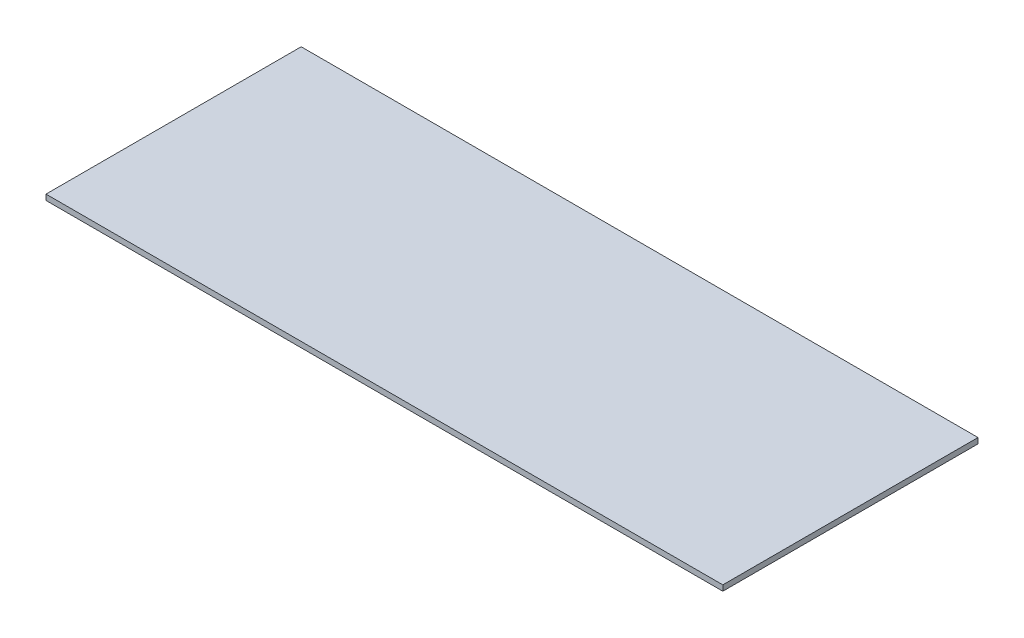
ISO-10303-21;
HEADER;
FILE_DESCRIPTION(('STEP AP214'),'2;1');
FILE_NAME('part.step','',(''),(''),'','','');
FILE_SCHEMA(('AUTOMOTIVE_DESIGN { 1 0 10303 214 1 1 1 1 }'));
ENDSEC;
DATA;
#1=APPLICATION_CONTEXT('core data for automotive mechanical design processes');
#2=APPLICATION_PROTOCOL_DEFINITION('international standard','automotive_design',2000,#1);
#3=PRODUCT_CONTEXT('',#1,'mechanical');
#4=PRODUCT('Part','Part','',(#3));
#5=PRODUCT_RELATED_PRODUCT_CATEGORY('part','',(#4));
#6=PRODUCT_DEFINITION_FORMATION('','',#4);
#7=PRODUCT_DEFINITION_CONTEXT('part definition',#1,'design');
#8=PRODUCT_DEFINITION('design','',#6,#7);
#9=PRODUCT_DEFINITION_SHAPE('','',#8);
#10=(LENGTH_UNIT() NAMED_UNIT(*) SI_UNIT(.MILLI.,.METRE.));
#11=(NAMED_UNIT(*) PLANE_ANGLE_UNIT() SI_UNIT($,.RADIAN.));
#12=(NAMED_UNIT(*) SI_UNIT($,.STERADIAN.) SOLID_ANGLE_UNIT());
#13=UNCERTAINTY_MEASURE_WITH_UNIT(LENGTH_MEASURE(1.E-05),#10,'distance_accuracy_value','');
#14=(GEOMETRIC_REPRESENTATION_CONTEXT(3) GLOBAL_UNCERTAINTY_ASSIGNED_CONTEXT((#13)) GLOBAL_UNIT_ASSIGNED_CONTEXT((#10,
#11,#12)) REPRESENTATION_CONTEXT('',''));
#15=CARTESIAN_POINT('',(0.,0.,0.));
#16=DIRECTION('',(0.,0.,1.));
#17=DIRECTION('',(1.,0.,0.));
#18=AXIS2_PLACEMENT_3D('',#15,#16,#17);
#19=CARTESIAN_POINT('',(1220.,20.,460.));
#20=DIRECTION('',(-1.,0.,0.));
#21=DIRECTION('',(0.,0.,1.));
#22=AXIS2_PLACEMENT_3D('',#19,#20,#21);
#23=PLANE('',#22);
#24=DIRECTION('',(0.,0.,-1.));
#25=VECTOR('',#24,1.);
#26=CARTESIAN_POINT('',(1220.,0.,460.));
#27=LINE('',#26,#25);
#28=CARTESIAN_POINT('',(1220.,0.,460.));
#29=VERTEX_POINT('',#28);
#30=CARTESIAN_POINT('',(1220.,0.,-460.));
#31=VERTEX_POINT('',#30);
#32=EDGE_CURVE('E100',#29,#31,#27,.T.);
#33=ORIENTED_EDGE('',*,*,#32,.T.);
#34=DIRECTION('',(0.,-1.,0.));
#35=VECTOR('',#34,1.);
#36=CARTESIAN_POINT('',(1220.,20.,-460.));
#37=LINE('',#36,#35);
#38=CARTESIAN_POINT('',(1220.,20.,-460.));
#39=VERTEX_POINT('',#38);
#40=EDGE_CURVE('E11',#39,#31,#37,.T.);
#41=ORIENTED_EDGE('',*,*,#40,.F.);
#42=DIRECTION('',(0.,0.,-1.));
#43=VECTOR('',#42,1.);
#44=CARTESIAN_POINT('',(1220.,20.,460.));
#45=LINE('',#44,#43);
#46=CARTESIAN_POINT('',(1220.,20.,460.));
#47=VERTEX_POINT('',#46);
#48=EDGE_CURVE('E88',#47,#39,#45,.T.);
#49=ORIENTED_EDGE('',*,*,#48,.F.);
#50=DIRECTION('',(0.,-1.,0.));
#51=VECTOR('',#50,1.);
#52=CARTESIAN_POINT('',(1220.,20.,460.));
#53=LINE('',#52,#51);
#54=EDGE_CURVE('E96',#47,#29,#53,.T.);
#55=ORIENTED_EDGE('',*,*,#54,.T.);
#56=EDGE_LOOP('',(#33,#41,#49,#55));
#57=FACE_BOUND('',#56,.T.);
#58=ADVANCED_FACE('F37',(#57),#23,.F.);
#59=CARTESIAN_POINT('',(-1220.,20.,-460.));
#60=DIRECTION('',(0.,0.,1.));
#61=DIRECTION('',(1.,0.,0.));
#62=AXIS2_PLACEMENT_3D('',#59,#60,#61);
#63=PLANE('',#62);
#64=DIRECTION('',(-1.,0.,0.));
#65=VECTOR('',#64,1.);
#66=CARTESIAN_POINT('',(-1220.,0.,-460.));
#67=LINE('',#66,#65);
#68=CARTESIAN_POINT('',(-1220.,0.,-460.));
#69=VERTEX_POINT('',#68);
#70=EDGE_CURVE('E92',#31,#69,#67,.T.);
#71=ORIENTED_EDGE('',*,*,#70,.T.);
#72=DIRECTION('',(0.,-1.,0.));
#73=VECTOR('',#72,1.);
#74=CARTESIAN_POINT('',(-1220.,20.,-460.));
#75=LINE('',#74,#73);
#76=CARTESIAN_POINT('',(-1220.,20.,-460.));
#77=VERTEX_POINT('',#76);
#78=EDGE_CURVE('E45',#77,#69,#75,.T.);
#79=ORIENTED_EDGE('',*,*,#78,.F.);
#80=DIRECTION('',(-1.,0.,0.));
#81=VECTOR('',#80,1.);
#82=CARTESIAN_POINT('',(-1220.,20.,-460.));
#83=LINE('',#82,#81);
#84=EDGE_CURVE('E83',#39,#77,#83,.T.);
#85=ORIENTED_EDGE('',*,*,#84,.F.);
#86=ORIENTED_EDGE('',*,*,#40,.T.);
#87=EDGE_LOOP('',(#71,#79,#85,#86));
#88=FACE_BOUND('',#87,.T.);
#89=ADVANCED_FACE('F91',(#88),#63,.F.);
#90=CARTESIAN_POINT('',(-1220.,20.,460.));
#91=DIRECTION('',(1.,0.,0.));
#92=DIRECTION('',(0.,0.,-1.));
#93=AXIS2_PLACEMENT_3D('',#90,#91,#92);
#94=PLANE('',#93);
#95=DIRECTION('',(0.,0.,1.));
#96=VECTOR('',#95,1.);
#97=CARTESIAN_POINT('',(-1220.,0.,460.));
#98=LINE('',#97,#96);
#99=CARTESIAN_POINT('',(-1220.,0.,460.));
#100=VERTEX_POINT('',#99);
#101=EDGE_CURVE('E70',#69,#100,#98,.T.);
#102=ORIENTED_EDGE('',*,*,#101,.T.);
#103=DIRECTION('',(0.,-1.,0.));
#104=VECTOR('',#103,1.);
#105=CARTESIAN_POINT('',(-1220.,20.,460.));
#106=LINE('',#105,#104);
#107=CARTESIAN_POINT('',(-1220.,20.,460.));
#108=VERTEX_POINT('',#107);
#109=EDGE_CURVE('E93',#108,#100,#106,.T.);
#110=ORIENTED_EDGE('',*,*,#109,.F.);
#111=DIRECTION('',(0.,0.,1.));
#112=VECTOR('',#111,1.);
#113=CARTESIAN_POINT('',(-1220.,20.,460.));
#114=LINE('',#113,#112);
#115=EDGE_CURVE('E86',#77,#108,#114,.T.);
#116=ORIENTED_EDGE('',*,*,#115,.F.);
#117=ORIENTED_EDGE('',*,*,#78,.T.);
#118=EDGE_LOOP('',(#102,#110,#116,#117));
#119=FACE_BOUND('',#118,.T.);
#120=ADVANCED_FACE('F94',(#119),#94,.F.);
#121=CARTESIAN_POINT('',(-1220.,20.,460.));
#122=DIRECTION('',(0.,0.,-1.));
#123=DIRECTION('',(-1.,0.,0.));
#124=AXIS2_PLACEMENT_3D('',#121,#122,#123);
#125=PLANE('',#124);
#126=DIRECTION('',(1.,0.,0.));
#127=VECTOR('',#126,1.);
#128=CARTESIAN_POINT('',(-1220.,0.,460.));
#129=LINE('',#128,#127);
#130=EDGE_CURVE('E76',#100,#29,#129,.T.);
#131=ORIENTED_EDGE('',*,*,#130,.T.);
#132=ORIENTED_EDGE('',*,*,#54,.F.);
#133=DIRECTION('',(1.,0.,0.));
#134=VECTOR('',#133,1.);
#135=CARTESIAN_POINT('',(-1220.,20.,460.));
#136=LINE('',#135,#134);
#137=EDGE_CURVE('E53',#108,#47,#136,.T.);
#138=ORIENTED_EDGE('',*,*,#137,.F.);
#139=ORIENTED_EDGE('',*,*,#109,.T.);
#140=EDGE_LOOP('',(#131,#132,#138,#139));
#141=FACE_BOUND('',#140,.T.);
#142=ADVANCED_FACE('F107',(#141),#125,.F.);
#143=CARTESIAN_POINT('',(0.,20.,0.));
#144=DIRECTION('',(0.,-1.,0.));
#145=DIRECTION('',(0.,0.,-1.));
#146=AXIS2_PLACEMENT_3D('',#143,#144,#145);
#147=PLANE('',#146);
#148=ORIENTED_EDGE('',*,*,#48,.T.);
#149=ORIENTED_EDGE('',*,*,#84,.T.);
#150=ORIENTED_EDGE('',*,*,#115,.T.);
#151=ORIENTED_EDGE('',*,*,#137,.T.);
#152=EDGE_LOOP('',(#148,#149,#150,#151));
#153=FACE_BOUND('',#152,.T.);
#154=ADVANCED_FACE('F84',(#153),#147,.F.);
#155=CARTESIAN_POINT('',(0.,0.,0.));
#156=DIRECTION('',(0.,-1.,0.));
#157=DIRECTION('',(0.,0.,-1.));
#158=AXIS2_PLACEMENT_3D('',#155,#156,#157);
#159=PLANE('',#158);
#160=ORIENTED_EDGE('',*,*,#32,.F.);
#161=ORIENTED_EDGE('',*,*,#130,.F.);
#162=ORIENTED_EDGE('',*,*,#101,.F.);
#163=ORIENTED_EDGE('',*,*,#70,.F.);
#164=EDGE_LOOP('',(#160,#161,#162,#163));
#165=FACE_BOUND('',#164,.T.);
#166=ADVANCED_FACE('F110',(#165),#159,.T.);
#167=CLOSED_SHELL('',(#58,#89,#120,#142,#154,#166));
#168=MANIFOLD_SOLID_BREP('B2',#167);
#169=ADVANCED_BREP_SHAPE_REPRESENTATION('',(#18,#168),#14);
#170=SHAPE_DEFINITION_REPRESENTATION(#9,#169);
ENDSEC;
END-ISO-10303-21;
